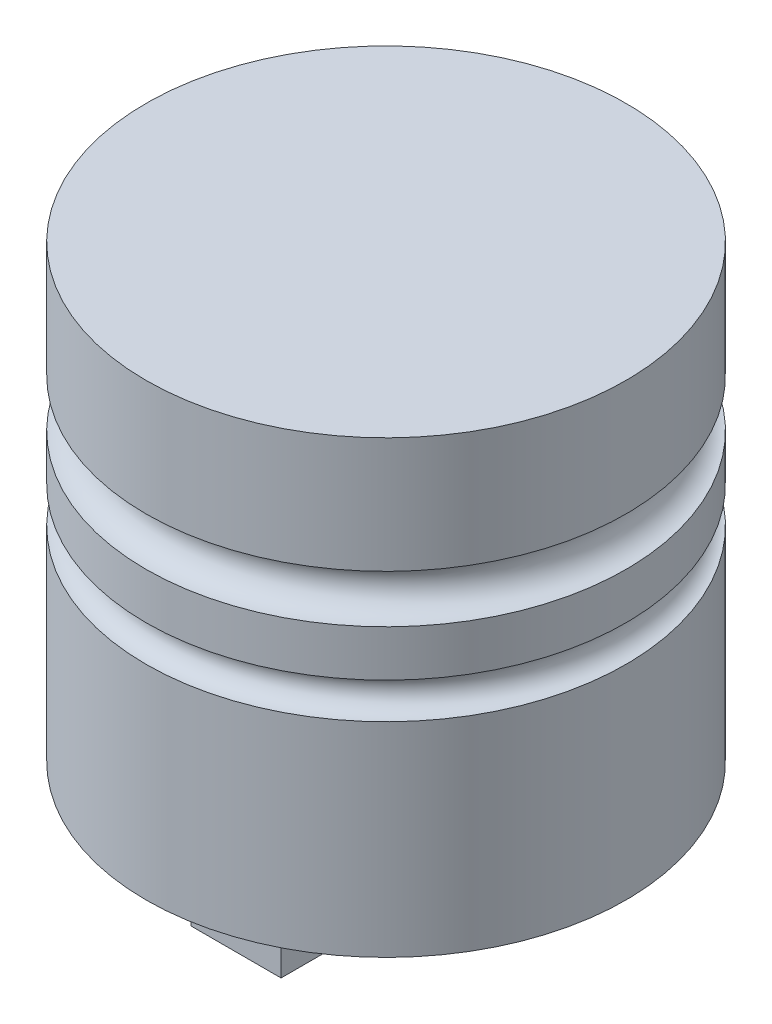
ISO-10303-21;
HEADER;
FILE_DESCRIPTION(('STEP AP214'),'2;1');
FILE_NAME('part.step','',(''),(''),'','','');
FILE_SCHEMA(('AUTOMOTIVE_DESIGN { 1 0 10303 214 1 1 1 1 }'));
ENDSEC;
DATA;
#1=APPLICATION_CONTEXT('core data for automotive mechanical design processes');
#2=APPLICATION_PROTOCOL_DEFINITION('international standard','automotive_design',2000,#1);
#3=PRODUCT_CONTEXT('',#1,'mechanical');
#4=PRODUCT('Part','Part','',(#3));
#5=PRODUCT_RELATED_PRODUCT_CATEGORY('part','',(#4));
#6=PRODUCT_DEFINITION_FORMATION('','',#4);
#7=PRODUCT_DEFINITION_CONTEXT('part definition',#1,'design');
#8=PRODUCT_DEFINITION('design','',#6,#7);
#9=PRODUCT_DEFINITION_SHAPE('','',#8);
#10=(LENGTH_UNIT() NAMED_UNIT(*) SI_UNIT(.MILLI.,.METRE.));
#11=(NAMED_UNIT(*) PLANE_ANGLE_UNIT() SI_UNIT($,.RADIAN.));
#12=(NAMED_UNIT(*) SI_UNIT($,.STERADIAN.) SOLID_ANGLE_UNIT());
#13=UNCERTAINTY_MEASURE_WITH_UNIT(LENGTH_MEASURE(1.E-05),#10,'distance_accuracy_value','');
#14=(GEOMETRIC_REPRESENTATION_CONTEXT(3) GLOBAL_UNCERTAINTY_ASSIGNED_CONTEXT((#13)) GLOBAL_UNIT_ASSIGNED_CONTEXT((#10,
#11,#12)) REPRESENTATION_CONTEXT('',''));
#15=CARTESIAN_POINT('',(0.,0.,0.));
#16=DIRECTION('',(0.,0.,1.));
#17=DIRECTION('',(1.,0.,0.));
#18=AXIS2_PLACEMENT_3D('',#15,#16,#17);
#19=CARTESIAN_POINT('',(15.,-105.397877984085,-20.));
#20=DIRECTION('',(0.,0.,-1.));
#21=DIRECTION('',(-1.,0.,0.));
#22=AXIS2_PLACEMENT_3D('',#19,#20,#21);
#23=PLANE('',#22);
#24=DIRECTION('',(-1.,0.,0.));
#25=VECTOR('',#24,1.);
#26=CARTESIAN_POINT('',(15.,-75.3978779840849,-20.));
#27=LINE('',#26,#25);
#28=CARTESIAN_POINT('',(15.,-75.3978779840849,-20.));
#29=VERTEX_POINT('',#28);
#30=CARTESIAN_POINT('',(-15.,-75.3978779840849,-20.));
#31=VERTEX_POINT('',#30);
#32=EDGE_CURVE('E159',#29,#31,#27,.T.);
#33=ORIENTED_EDGE('',*,*,#32,.T.);
#34=DIRECTION('',(0.,1.,0.));
#35=VECTOR('',#34,1.);
#36=CARTESIAN_POINT('',(-15.,-105.397877984085,-20.));
#37=LINE('',#36,#35);
#38=CARTESIAN_POINT('',(-15.,-105.397877984085,-20.));
#39=VERTEX_POINT('',#38);
#40=EDGE_CURVE('E166',#39,#31,#37,.T.);
#41=ORIENTED_EDGE('',*,*,#40,.F.);
#42=DIRECTION('',(-1.,0.,0.));
#43=VECTOR('',#42,1.);
#44=CARTESIAN_POINT('',(15.,-105.397877984085,-20.));
#45=LINE('',#44,#43);
#46=CARTESIAN_POINT('',(15.,-105.397877984085,-20.));
#47=VERTEX_POINT('',#46);
#48=EDGE_CURVE('E152',#47,#39,#45,.T.);
#49=ORIENTED_EDGE('',*,*,#48,.F.);
#50=DIRECTION('',(0.,1.,0.));
#51=VECTOR('',#50,1.);
#52=CARTESIAN_POINT('',(15.,-105.397877984085,-20.));
#53=LINE('',#52,#51);
#54=EDGE_CURVE('E169',#47,#29,#53,.T.);
#55=ORIENTED_EDGE('',*,*,#54,.T.);
#56=EDGE_LOOP('',(#33,#41,#49,#55));
#57=FACE_BOUND('',#56,.T.);
#58=CARTESIAN_POINT('',(0.,-90.3978779840849,-20.));
#59=DIRECTION('',(0.,0.,-1.));
#60=DIRECTION('',(-1.,0.,0.));
#61=AXIS2_PLACEMENT_3D('',#58,#59,#60);
#62=CIRCLE('',#61,10.);
#63=CARTESIAN_POINT('',(-9.99999999999997,-90.3978779840849,-20.));
#64=VERTEX_POINT('',#63);
#65=EDGE_CURVE('E13',#64,#64,#62,.F.);
#66=ORIENTED_EDGE('',*,*,#65,.F.);
#67=EDGE_LOOP('',(#66));
#68=FACE_BOUND('',#67,.T.);
#69=ADVANCED_FACE('F50',(#57,#68),#23,.F.);
#70=CARTESIAN_POINT('',(15.,-105.397877984085,20.));
#71=DIRECTION('',(0.,0.,1.));
#72=DIRECTION('',(1.,0.,0.));
#73=AXIS2_PLACEMENT_3D('',#70,#71,#72);
#74=PLANE('',#73);
#75=DIRECTION('',(1.,0.,0.));
#76=VECTOR('',#75,1.);
#77=CARTESIAN_POINT('',(15.,-75.3978779840849,20.));
#78=LINE('',#77,#76);
#79=CARTESIAN_POINT('',(-15.,-75.3978779840849,20.));
#80=VERTEX_POINT('',#79);
#81=CARTESIAN_POINT('',(15.,-75.3978779840849,20.));
#82=VERTEX_POINT('',#81);
#83=EDGE_CURVE('E65',#80,#82,#78,.T.);
#84=ORIENTED_EDGE('',*,*,#83,.T.);
#85=DIRECTION('',(0.,1.,0.));
#86=VECTOR('',#85,1.);
#87=CARTESIAN_POINT('',(15.,-105.397877984085,20.));
#88=LINE('',#87,#86);
#89=CARTESIAN_POINT('',(15.,-105.397877984085,20.));
#90=VERTEX_POINT('',#89);
#91=EDGE_CURVE('E120',#90,#82,#88,.T.);
#92=ORIENTED_EDGE('',*,*,#91,.F.);
#93=DIRECTION('',(1.,0.,0.));
#94=VECTOR('',#93,1.);
#95=CARTESIAN_POINT('',(15.,-105.397877984085,20.));
#96=LINE('',#95,#94);
#97=CARTESIAN_POINT('',(-15.,-105.397877984085,20.));
#98=VERTEX_POINT('',#97);
#99=EDGE_CURVE('E112',#98,#90,#96,.T.);
#100=ORIENTED_EDGE('',*,*,#99,.F.);
#101=DIRECTION('',(0.,1.,0.));
#102=VECTOR('',#101,1.);
#103=CARTESIAN_POINT('',(-15.,-105.397877984085,20.));
#104=LINE('',#103,#102);
#105=EDGE_CURVE('E117',#98,#80,#104,.T.);
#106=ORIENTED_EDGE('',*,*,#105,.T.);
#107=EDGE_LOOP('',(#84,#92,#100,#106));
#108=FACE_BOUND('',#107,.T.);
#109=CARTESIAN_POINT('',(0.,-90.3978779840849,20.));
#110=DIRECTION('',(0.,0.,1.));
#111=DIRECTION('',(1.,0.,0.));
#112=AXIS2_PLACEMENT_3D('',#109,#110,#111);
#113=CIRCLE('',#112,10.);
#114=CARTESIAN_POINT('',(10.,-90.3978779840849,20.));
#115=VERTEX_POINT('',#114);
#116=EDGE_CURVE('E58',#115,#115,#113,.F.);
#117=ORIENTED_EDGE('',*,*,#116,.F.);
#118=EDGE_LOOP('',(#117));
#119=FACE_BOUND('',#118,.T.);
#120=ADVANCED_FACE('F114',(#108,#119),#74,.F.);
#121=CARTESIAN_POINT('',(0.,-75.3978779840849,0.));
#122=DIRECTION('',(0.,1.,0.));
#123=DIRECTION('',(0.,0.,1.));
#124=AXIS2_PLACEMENT_3D('',#121,#122,#123);
#125=PLANE('',#124);
#126=DIRECTION('',(1.,0.,0.));
#127=VECTOR('',#126,1.);
#128=CARTESIAN_POINT('',(-15.,-75.3978779840849,-50.));
#129=LINE('',#128,#127);
#130=CARTESIAN_POINT('',(-15.,-75.3978779840849,-50.));
#131=VERTEX_POINT('',#130);
#132=CARTESIAN_POINT('',(15.,-75.3978779840849,-50.));
#133=VERTEX_POINT('',#132);
#134=EDGE_CURVE('E137',#131,#133,#129,.T.);
#135=ORIENTED_EDGE('',*,*,#134,.F.);
#136=DIRECTION('',(0.,0.,-1.));
#137=VECTOR('',#136,1.);
#138=CARTESIAN_POINT('',(-15.,-75.3978779840849,-20.));
#139=LINE('',#138,#137);
#140=EDGE_CURVE('E150',#31,#131,#139,.T.);
#141=ORIENTED_EDGE('',*,*,#140,.F.);
#142=ORIENTED_EDGE('',*,*,#32,.F.);
#143=DIRECTION('',(0.,0.,1.));
#144=VECTOR('',#143,1.);
#145=CARTESIAN_POINT('',(15.,-75.3978779840849,-20.));
#146=LINE('',#145,#144);
#147=EDGE_CURVE('E140',#133,#29,#146,.T.);
#148=ORIENTED_EDGE('',*,*,#147,.F.);
#149=EDGE_LOOP('',(#135,#141,#142,#148));
#150=FACE_BOUND('',#149,.T.);
#151=CARTESIAN_POINT('',(0.,-75.3978779840848,0.));
#152=DIRECTION('',(0.,1.,0.));
#153=DIRECTION('',(0.,0.,1.));
#154=AXIS2_PLACEMENT_3D('',#151,#152,#153);
#155=CIRCLE('',#154,80.);
#156=CARTESIAN_POINT('',(0.,-75.3978779840848,80.));
#157=VERTEX_POINT('',#156);
#158=EDGE_CURVE('E190',#157,#157,#155,.T.);
#159=ORIENTED_EDGE('',*,*,#158,.F.);
#160=EDGE_LOOP('',(#159));
#161=FACE_BOUND('',#160,.T.);
#162=DIRECTION('',(0.,0.,-1.));
#163=VECTOR('',#162,1.);
#164=CARTESIAN_POINT('',(-15.,-75.3978779840849,50.));
#165=LINE('',#164,#163);
#166=CARTESIAN_POINT('',(-15.,-75.3978779840849,50.));
#167=VERTEX_POINT('',#166);
#168=EDGE_CURVE('E136',#167,#80,#165,.T.);
#169=ORIENTED_EDGE('',*,*,#168,.F.);
#170=DIRECTION('',(-1.,0.,0.));
#171=VECTOR('',#170,1.);
#172=CARTESIAN_POINT('',(-15.,-75.3978779840849,50.));
#173=LINE('',#172,#171);
#174=CARTESIAN_POINT('',(15.,-75.3978779840849,50.));
#175=VERTEX_POINT('',#174);
#176=EDGE_CURVE('E133',#175,#167,#173,.T.);
#177=ORIENTED_EDGE('',*,*,#176,.F.);
#178=DIRECTION('',(0.,0.,1.));
#179=VECTOR('',#178,1.);
#180=CARTESIAN_POINT('',(15.,-75.3978779840849,50.));
#181=LINE('',#180,#179);
#182=EDGE_CURVE('E70',#82,#175,#181,.T.);
#183=ORIENTED_EDGE('',*,*,#182,.F.);
#184=ORIENTED_EDGE('',*,*,#83,.F.);
#185=EDGE_LOOP('',(#169,#177,#183,#184));
#186=FACE_BOUND('',#185,.T.);
#187=ADVANCED_FACE('F198',(#150,#161,#186),#125,.F.);
#188=CARTESIAN_POINT('',(0.,74.6021220159151,0.));
#189=DIRECTION('',(0.,-1.,0.));
#190=DIRECTION('',(0.,0.,-1.));
#191=AXIS2_PLACEMENT_3D('',#188,#189,#190);
#192=PLANE('',#191);
#193=CARTESIAN_POINT('',(0.,74.6021220159152,0.));
#194=DIRECTION('',(0.,1.,0.));
#195=DIRECTION('',(0.,0.,1.));
#196=AXIS2_PLACEMENT_3D('',#193,#194,#195);
#197=CIRCLE('',#196,80.);
#198=CARTESIAN_POINT('',(0.,74.6021220159152,80.));
#199=VERTEX_POINT('',#198);
#200=EDGE_CURVE('E175',#199,#199,#197,.T.);
#201=ORIENTED_EDGE('',*,*,#200,.T.);
#202=EDGE_LOOP('',(#201));
#203=FACE_BOUND('',#202,.T.);
#204=ADVANCED_FACE('F52',(#203),#192,.F.);
#205=CARTESIAN_POINT('',(0.,74.6021220159151,0.));
#206=DIRECTION('',(0.,1.,0.));
#207=DIRECTION('',(0.,0.,1.));
#208=AXIS2_PLACEMENT_3D('',#205,#206,#207);
#209=CYLINDRICAL_SURFACE('',#208,80.);
#210=CARTESIAN_POINT('',(0.,-7.36074270557022,0.));
#211=DIRECTION('',(0.,1.,0.));
#212=DIRECTION('',(0.,0.,1.));
#213=AXIS2_PLACEMENT_3D('',#210,#211,#212);
#214=CIRCLE('',#213,80.);
#215=CARTESIAN_POINT('',(0.,-7.36074270557022,80.));
#216=VERTEX_POINT('',#215);
#217=EDGE_CURVE('E187',#216,#216,#214,.T.);
#218=ORIENTED_EDGE('',*,*,#217,.F.);
#219=EDGE_LOOP('',(#218));
#220=FACE_BOUND('',#219,.T.);
#221=ORIENTED_EDGE('',*,*,#158,.T.);
#222=EDGE_LOOP('',(#221));
#223=FACE_BOUND('',#222,.T.);
#224=ADVANCED_FACE('F244',(#220,#223),#209,.T.);
#225=CARTESIAN_POINT('',(0.,-1.36074270557022,0.));
#226=DIRECTION('',(0.,1.,0.));
#227=DIRECTION('',(0.,0.,1.));
#228=AXIS2_PLACEMENT_3D('',#225,#226,#227);
#229=TOROIDAL_SURFACE('',#228,80.,6.);
#230=CARTESIAN_POINT('',(0.,4.63925729442978,0.));
#231=DIRECTION('',(0.,1.,0.));
#232=DIRECTION('',(0.,0.,1.));
#233=AXIS2_PLACEMENT_3D('',#230,#231,#232);
#234=CIRCLE('',#233,80.);
#235=CARTESIAN_POINT('',(0.,4.63925729442978,80.));
#236=VERTEX_POINT('',#235);
#237=EDGE_CURVE('E184',#236,#236,#234,.T.);
#238=ORIENTED_EDGE('',*,*,#237,.F.);
#239=EDGE_LOOP('',(#238));
#240=FACE_BOUND('',#239,.T.);
#241=ORIENTED_EDGE('',*,*,#217,.T.);
#242=EDGE_LOOP('',(#241));
#243=FACE_BOUND('',#242,.T.);
#244=ADVANCED_FACE('F240',(#240,#243),#229,.F.);
#245=CARTESIAN_POINT('',(0.,74.6021220159151,0.));
#246=DIRECTION('',(0.,1.,0.));
#247=DIRECTION('',(0.,0.,1.));
#248=AXIS2_PLACEMENT_3D('',#245,#246,#247);
#249=CYLINDRICAL_SURFACE('',#248,80.);
#250=CARTESIAN_POINT('',(0.,20.0503978779841,0.));
#251=DIRECTION('',(0.,1.,0.));
#252=DIRECTION('',(0.,0.,1.));
#253=AXIS2_PLACEMENT_3D('',#250,#251,#252);
#254=CIRCLE('',#253,80.);
#255=CARTESIAN_POINT('',(0.,20.0503978779841,80.));
#256=VERTEX_POINT('',#255);
#257=EDGE_CURVE('E181',#256,#256,#254,.T.);
#258=ORIENTED_EDGE('',*,*,#257,.F.);
#259=EDGE_LOOP('',(#258));
#260=FACE_BOUND('',#259,.T.);
#261=ORIENTED_EDGE('',*,*,#237,.T.);
#262=EDGE_LOOP('',(#261));
#263=FACE_BOUND('',#262,.T.);
#264=ADVANCED_FACE('F236',(#260,#263),#249,.T.);
#265=CARTESIAN_POINT('',(0.,28.0503978779841,0.));
#266=DIRECTION('',(0.,1.,0.));
#267=DIRECTION('',(0.,0.,1.));
#268=AXIS2_PLACEMENT_3D('',#265,#266,#267);
#269=TOROIDAL_SURFACE('',#268,80.,8.);
#270=CARTESIAN_POINT('',(0.,36.0503978779841,0.));
#271=DIRECTION('',(0.,1.,0.));
#272=DIRECTION('',(0.,0.,1.));
#273=AXIS2_PLACEMENT_3D('',#270,#271,#272);
#274=CIRCLE('',#273,80.);
#275=CARTESIAN_POINT('',(0.,36.0503978779841,80.));
#276=VERTEX_POINT('',#275);
#277=EDGE_CURVE('E178',#276,#276,#274,.T.);
#278=ORIENTED_EDGE('',*,*,#277,.F.);
#279=EDGE_LOOP('',(#278));
#280=FACE_BOUND('',#279,.T.);
#281=ORIENTED_EDGE('',*,*,#257,.T.);
#282=EDGE_LOOP('',(#281));
#283=FACE_BOUND('',#282,.T.);
#284=ADVANCED_FACE('F232',(#280,#283),#269,.F.);
#285=CARTESIAN_POINT('',(0.,74.6021220159151,0.));
#286=DIRECTION('',(0.,1.,0.));
#287=DIRECTION('',(0.,0.,1.));
#288=AXIS2_PLACEMENT_3D('',#285,#286,#287);
#289=CYLINDRICAL_SURFACE('',#288,80.);
#290=ORIENTED_EDGE('',*,*,#200,.F.);
#291=EDGE_LOOP('',(#290));
#292=FACE_BOUND('',#291,.T.);
#293=ORIENTED_EDGE('',*,*,#277,.T.);
#294=EDGE_LOOP('',(#293));
#295=FACE_BOUND('',#294,.T.);
#296=ADVANCED_FACE('F228',(#292,#295),#289,.T.);
#297=CARTESIAN_POINT('',(-15.,-105.397877984085,-50.));
#298=DIRECTION('',(0.,0.,1.));
#299=DIRECTION('',(1.,0.,0.));
#300=AXIS2_PLACEMENT_3D('',#297,#298,#299);
#301=PLANE('',#300);
#302=ORIENTED_EDGE('',*,*,#134,.T.);
#303=DIRECTION('',(0.,1.,0.));
#304=VECTOR('',#303,1.);
#305=CARTESIAN_POINT('',(15.,-105.397877984085,-50.));
#306=LINE('',#305,#304);
#307=CARTESIAN_POINT('',(15.,-105.397877984085,-50.));
#308=VERTEX_POINT('',#307);
#309=EDGE_CURVE('E172',#308,#133,#306,.T.);
#310=ORIENTED_EDGE('',*,*,#309,.F.);
#311=DIRECTION('',(1.,0.,0.));
#312=VECTOR('',#311,1.);
#313=CARTESIAN_POINT('',(-15.,-105.397877984085,-50.));
#314=LINE('',#313,#312);
#315=CARTESIAN_POINT('',(-15.,-105.397877984085,-50.));
#316=VERTEX_POINT('',#315);
#317=EDGE_CURVE('E146',#316,#308,#314,.T.);
#318=ORIENTED_EDGE('',*,*,#317,.F.);
#319=DIRECTION('',(0.,1.,0.));
#320=VECTOR('',#319,1.);
#321=CARTESIAN_POINT('',(-15.,-105.397877984085,-50.));
#322=LINE('',#321,#320);
#323=EDGE_CURVE('E155',#316,#131,#322,.T.);
#324=ORIENTED_EDGE('',*,*,#323,.T.);
#325=EDGE_LOOP('',(#302,#310,#318,#324));
#326=FACE_BOUND('',#325,.T.);
#327=ADVANCED_FACE('F224',(#326),#301,.F.);
#328=CARTESIAN_POINT('',(15.,-105.397877984085,-20.));
#329=DIRECTION('',(-1.,0.,0.));
#330=DIRECTION('',(0.,0.,1.));
#331=AXIS2_PLACEMENT_3D('',#328,#329,#330);
#332=PLANE('',#331);
#333=ORIENTED_EDGE('',*,*,#147,.T.);
#334=ORIENTED_EDGE('',*,*,#54,.F.);
#335=DIRECTION('',(0.,0.,1.));
#336=VECTOR('',#335,1.);
#337=CARTESIAN_POINT('',(15.,-105.397877984085,-20.));
#338=LINE('',#337,#336);
#339=EDGE_CURVE('E149',#308,#47,#338,.T.);
#340=ORIENTED_EDGE('',*,*,#339,.F.);
#341=ORIENTED_EDGE('',*,*,#309,.T.);
#342=EDGE_LOOP('',(#333,#334,#340,#341));
#343=FACE_BOUND('',#342,.T.);
#344=ADVANCED_FACE('F219',(#343),#332,.F.);
#345=CARTESIAN_POINT('',(-15.,-105.397877984085,-20.));
#346=DIRECTION('',(1.,0.,0.));
#347=DIRECTION('',(0.,0.,-1.));
#348=AXIS2_PLACEMENT_3D('',#345,#346,#347);
#349=PLANE('',#348);
#350=ORIENTED_EDGE('',*,*,#140,.T.);
#351=ORIENTED_EDGE('',*,*,#323,.F.);
#352=DIRECTION('',(0.,0.,-1.));
#353=VECTOR('',#352,1.);
#354=CARTESIAN_POINT('',(-15.,-105.397877984085,-20.));
#355=LINE('',#354,#353);
#356=EDGE_CURVE('E154',#39,#316,#355,.T.);
#357=ORIENTED_EDGE('',*,*,#356,.F.);
#358=ORIENTED_EDGE('',*,*,#40,.T.);
#359=EDGE_LOOP('',(#350,#351,#357,#358));
#360=FACE_BOUND('',#359,.T.);
#361=ADVANCED_FACE('F216',(#360),#349,.F.);
#362=CARTESIAN_POINT('',(0.,-105.397877984085,0.));
#363=DIRECTION('',(0.,1.,0.));
#364=DIRECTION('',(0.,0.,1.));
#365=AXIS2_PLACEMENT_3D('',#362,#363,#364);
#366=PLANE('',#365);
#367=ORIENTED_EDGE('',*,*,#317,.T.);
#368=ORIENTED_EDGE('',*,*,#339,.T.);
#369=ORIENTED_EDGE('',*,*,#48,.T.);
#370=ORIENTED_EDGE('',*,*,#356,.T.);
#371=EDGE_LOOP('',(#367,#368,#369,#370));
#372=FACE_BOUND('',#371,.T.);
#373=ADVANCED_FACE('F213',(#372),#366,.F.);
#374=CARTESIAN_POINT('',(-15.,-105.397877984085,50.));
#375=DIRECTION('',(1.,0.,0.));
#376=DIRECTION('',(0.,0.,-1.));
#377=AXIS2_PLACEMENT_3D('',#374,#375,#376);
#378=PLANE('',#377);
#379=ORIENTED_EDGE('',*,*,#168,.T.);
#380=ORIENTED_EDGE('',*,*,#105,.F.);
#381=DIRECTION('',(0.,0.,-1.));
#382=VECTOR('',#381,1.);
#383=CARTESIAN_POINT('',(-15.,-105.397877984085,50.));
#384=LINE('',#383,#382);
#385=CARTESIAN_POINT('',(-15.,-105.397877984085,50.));
#386=VERTEX_POINT('',#385);
#387=EDGE_CURVE('E124',#386,#98,#384,.T.);
#388=ORIENTED_EDGE('',*,*,#387,.F.);
#389=DIRECTION('',(0.,1.,0.));
#390=VECTOR('',#389,1.);
#391=CARTESIAN_POINT('',(-15.,-105.397877984085,50.));
#392=LINE('',#391,#390);
#393=EDGE_CURVE('E261',#386,#167,#392,.T.);
#394=ORIENTED_EDGE('',*,*,#393,.T.);
#395=EDGE_LOOP('',(#379,#380,#388,#394));
#396=FACE_BOUND('',#395,.T.);
#397=ADVANCED_FACE('F135',(#396),#378,.F.);
#398=CARTESIAN_POINT('',(15.,-105.397877984085,50.));
#399=DIRECTION('',(-1.,0.,0.));
#400=DIRECTION('',(0.,0.,1.));
#401=AXIS2_PLACEMENT_3D('',#398,#399,#400);
#402=PLANE('',#401);
#403=ORIENTED_EDGE('',*,*,#182,.T.);
#404=DIRECTION('',(0.,1.,0.));
#405=VECTOR('',#404,1.);
#406=CARTESIAN_POINT('',(15.,-105.397877984085,50.));
#407=LINE('',#406,#405);
#408=CARTESIAN_POINT('',(15.,-105.397877984085,50.));
#409=VERTEX_POINT('',#408);
#410=EDGE_CURVE('E142',#409,#175,#407,.T.);
#411=ORIENTED_EDGE('',*,*,#410,.F.);
#412=DIRECTION('',(0.,0.,1.));
#413=VECTOR('',#412,1.);
#414=CARTESIAN_POINT('',(15.,-105.397877984085,50.));
#415=LINE('',#414,#413);
#416=EDGE_CURVE('E123',#90,#409,#415,.T.);
#417=ORIENTED_EDGE('',*,*,#416,.F.);
#418=ORIENTED_EDGE('',*,*,#91,.T.);
#419=EDGE_LOOP('',(#403,#411,#417,#418));
#420=FACE_BOUND('',#419,.T.);
#421=ADVANCED_FACE('F209',(#420),#402,.F.);
#422=CARTESIAN_POINT('',(-15.,-105.397877984085,50.));
#423=DIRECTION('',(0.,0.,-1.));
#424=DIRECTION('',(-1.,0.,0.));
#425=AXIS2_PLACEMENT_3D('',#422,#423,#424);
#426=PLANE('',#425);
#427=ORIENTED_EDGE('',*,*,#176,.T.);
#428=ORIENTED_EDGE('',*,*,#393,.F.);
#429=DIRECTION('',(-1.,0.,0.));
#430=VECTOR('',#429,1.);
#431=CARTESIAN_POINT('',(-15.,-105.397877984085,50.));
#432=LINE('',#431,#430);
#433=EDGE_CURVE('E129',#409,#386,#432,.T.);
#434=ORIENTED_EDGE('',*,*,#433,.F.);
#435=ORIENTED_EDGE('',*,*,#410,.T.);
#436=EDGE_LOOP('',(#427,#428,#434,#435));
#437=FACE_BOUND('',#436,.T.);
#438=ADVANCED_FACE('F260',(#437),#426,.F.);
#439=CARTESIAN_POINT('',(0.,-105.397877984085,0.));
#440=DIRECTION('',(0.,1.,0.));
#441=DIRECTION('',(0.,0.,1.));
#442=AXIS2_PLACEMENT_3D('',#439,#440,#441);
#443=PLANE('',#442);
#444=ORIENTED_EDGE('',*,*,#387,.T.);
#445=ORIENTED_EDGE('',*,*,#99,.T.);
#446=ORIENTED_EDGE('',*,*,#416,.T.);
#447=ORIENTED_EDGE('',*,*,#433,.T.);
#448=EDGE_LOOP('',(#444,#445,#446,#447));
#449=FACE_BOUND('',#448,.T.);
#450=ADVANCED_FACE('F127',(#449),#443,.F.);
#451=CARTESIAN_POINT('',(0.,-90.3978779840849,-48.2842712474619));
#452=DIRECTION('',(0.,0.,1.));
#453=DIRECTION('',(1.,0.,0.));
#454=AXIS2_PLACEMENT_3D('',#451,#452,#453);
#455=CYLINDRICAL_SURFACE('',#454,10.);
#456=ORIENTED_EDGE('',*,*,#116,.T.);
#457=EDGE_LOOP('',(#456));
#458=FACE_BOUND('',#457,.T.);
#459=ORIENTED_EDGE('',*,*,#65,.T.);
#460=EDGE_LOOP('',(#459));
#461=FACE_BOUND('',#460,.T.);
#462=ADVANCED_FACE('F195',(#458,#461),#455,.T.);
#463=CLOSED_SHELL('',(#69,#120,#187,#204,#224,#244,#264,#284,#296,#327,#344,#361,#373,#397,#421,
#438,#450,#462));
#464=MANIFOLD_SOLID_BREP('B2',#463);
#465=ADVANCED_BREP_SHAPE_REPRESENTATION('',(#18,#464),#14);
#466=SHAPE_DEFINITION_REPRESENTATION(#9,#465);
ENDSEC;
END-ISO-10303-21;
